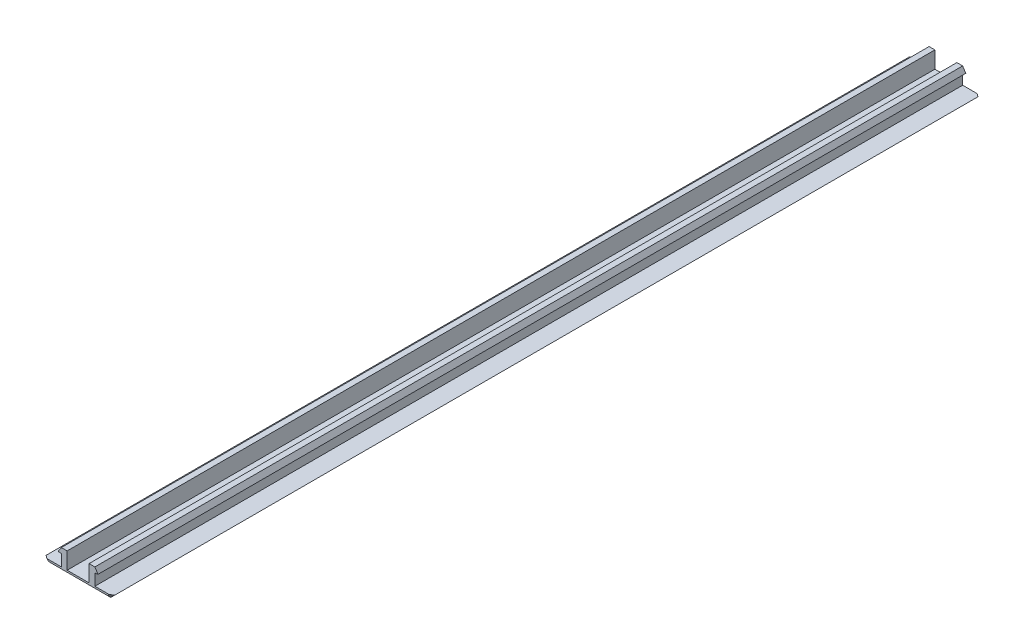
ISO-10303-21;
HEADER;
FILE_DESCRIPTION(('STEP AP214'),'2;1');
FILE_NAME('part.step','',(''),(''),'','','');
FILE_SCHEMA(('AUTOMOTIVE_DESIGN { 1 0 10303 214 1 1 1 1 }'));
ENDSEC;
DATA;
#1=APPLICATION_CONTEXT('core data for automotive mechanical design processes');
#2=APPLICATION_PROTOCOL_DEFINITION('international standard','automotive_design',2000,#1);
#3=PRODUCT_CONTEXT('',#1,'mechanical');
#4=PRODUCT('Part','Part','',(#3));
#5=PRODUCT_RELATED_PRODUCT_CATEGORY('part','',(#4));
#6=PRODUCT_DEFINITION_FORMATION('','',#4);
#7=PRODUCT_DEFINITION_CONTEXT('part definition',#1,'design');
#8=PRODUCT_DEFINITION('design','',#6,#7);
#9=PRODUCT_DEFINITION_SHAPE('','',#8);
#10=(LENGTH_UNIT() NAMED_UNIT(*) SI_UNIT(.MILLI.,.METRE.));
#11=(NAMED_UNIT(*) PLANE_ANGLE_UNIT() SI_UNIT($,.RADIAN.));
#12=(NAMED_UNIT(*) SI_UNIT($,.STERADIAN.) SOLID_ANGLE_UNIT());
#13=UNCERTAINTY_MEASURE_WITH_UNIT(LENGTH_MEASURE(1.E-05),#10,'distance_accuracy_value','');
#14=(GEOMETRIC_REPRESENTATION_CONTEXT(3) GLOBAL_UNCERTAINTY_ASSIGNED_CONTEXT((#13)) GLOBAL_UNIT_ASSIGNED_CONTEXT((#10,
#11,#12)) REPRESENTATION_CONTEXT('',''));
#15=CARTESIAN_POINT('',(0.,0.,0.));
#16=DIRECTION('',(0.,0.,1.));
#17=DIRECTION('',(1.,0.,0.));
#18=AXIS2_PLACEMENT_3D('',#15,#16,#17);
#19=CARTESIAN_POINT('',(0.,0.707109999999999,150.));
#20=DIRECTION('',(0.,-1.,0.));
#21=DIRECTION('',(0.,0.,-1.));
#22=AXIS2_PLACEMENT_3D('',#19,#20,#21);
#23=PLANE('',#22);
#24=DIRECTION('',(-1.,0.,0.));
#25=VECTOR('',#24,1.);
#26=CARTESIAN_POINT('',(0.,0.707109999999999,0.));
#27=LINE('',#26,#25);
#28=CARTESIAN_POINT('',(1.9,0.707109999999999,0.));
#29=VERTEX_POINT('',#28);
#30=CARTESIAN_POINT('',(-1.9,0.707109999999999,0.));
#31=VERTEX_POINT('',#30);
#32=EDGE_CURVE('E198',#29,#31,#27,.T.);
#33=ORIENTED_EDGE('',*,*,#32,.T.);
#34=DIRECTION('',(0.,0.,-1.));
#35=VECTOR('',#34,1.);
#36=CARTESIAN_POINT('',(-1.9,0.707109999999999,150.));
#37=LINE('',#36,#35);
#38=CARTESIAN_POINT('',(-1.9,0.707109999999999,150.));
#39=VERTEX_POINT('',#38);
#40=EDGE_CURVE('E196',#39,#31,#37,.T.);
#41=ORIENTED_EDGE('',*,*,#40,.F.);
#42=DIRECTION('',(-1.,0.,0.));
#43=VECTOR('',#42,1.);
#44=CARTESIAN_POINT('',(0.,0.707109999999999,150.));
#45=LINE('',#44,#43);
#46=CARTESIAN_POINT('',(1.9,0.707109999999999,150.));
#47=VERTEX_POINT('',#46);
#48=EDGE_CURVE('E180',#47,#39,#45,.T.);
#49=ORIENTED_EDGE('',*,*,#48,.F.);
#50=DIRECTION('',(0.,0.,-1.));
#51=VECTOR('',#50,1.);
#52=CARTESIAN_POINT('',(1.9,0.707109999999999,150.));
#53=LINE('',#52,#51);
#54=EDGE_CURVE('E232',#47,#29,#53,.T.);
#55=ORIENTED_EDGE('',*,*,#54,.T.);
#56=EDGE_LOOP('',(#33,#41,#49,#55));
#57=FACE_BOUND('',#56,.T.);
#58=ADVANCED_FACE('F41',(#57),#23,.F.);
#59=CARTESIAN_POINT('',(-1.9,0.,150.));
#60=DIRECTION('',(1.,0.,0.));
#61=DIRECTION('',(0.,1.,0.));
#62=AXIS2_PLACEMENT_3D('',#59,#60,#61);
#63=PLANE('',#62);
#64=DIRECTION('',(0.,-1.,0.));
#65=VECTOR('',#64,1.);
#66=CARTESIAN_POINT('',(-1.9,0.,0.));
#67=LINE('',#66,#65);
#68=CARTESIAN_POINT('',(-1.9,3.60069,0.));
#69=VERTEX_POINT('',#68);
#70=EDGE_CURVE('E234',#69,#31,#67,.T.);
#71=ORIENTED_EDGE('',*,*,#70,.F.);
#72=DIRECTION('',(0.,0.,-1.));
#73=VECTOR('',#72,1.);
#74=CARTESIAN_POINT('',(-1.9,3.60069,150.));
#75=LINE('',#74,#73);
#76=CARTESIAN_POINT('',(-1.9,3.60069,150.));
#77=VERTEX_POINT('',#76);
#78=EDGE_CURVE('E203',#77,#69,#75,.T.);
#79=ORIENTED_EDGE('',*,*,#78,.F.);
#80=DIRECTION('',(0.,-1.,0.));
#81=VECTOR('',#80,1.);
#82=CARTESIAN_POINT('',(-1.9,0.,150.));
#83=LINE('',#82,#81);
#84=EDGE_CURVE('E186',#77,#39,#83,.T.);
#85=ORIENTED_EDGE('',*,*,#84,.T.);
#86=ORIENTED_EDGE('',*,*,#40,.T.);
#87=EDGE_LOOP('',(#71,#79,#85,#86));
#88=FACE_BOUND('',#87,.T.);
#89=ADVANCED_FACE('F205',(#88),#63,.T.);
#90=CARTESIAN_POINT('',(0.,3.60069,150.));
#91=DIRECTION('',(0.,1.,0.));
#92=DIRECTION('',(-1.,0.,0.));
#93=AXIS2_PLACEMENT_3D('',#90,#91,#92);
#94=PLANE('',#93);
#95=DIRECTION('',(1.,0.,0.));
#96=VECTOR('',#95,1.);
#97=CARTESIAN_POINT('',(0.,3.60069,0.));
#98=LINE('',#97,#96);
#99=CARTESIAN_POINT('',(-2.9,3.60069,0.));
#100=VERTEX_POINT('',#99);
#101=EDGE_CURVE('E237',#100,#69,#98,.T.);
#102=ORIENTED_EDGE('',*,*,#101,.F.);
#103=DIRECTION('',(0.,0.,-1.));
#104=VECTOR('',#103,1.);
#105=CARTESIAN_POINT('',(-2.9,3.60069,150.));
#106=LINE('',#105,#104);
#107=CARTESIAN_POINT('',(-2.9,3.60069,150.));
#108=VERTEX_POINT('',#107);
#109=EDGE_CURVE('E297',#108,#100,#106,.T.);
#110=ORIENTED_EDGE('',*,*,#109,.F.);
#111=DIRECTION('',(1.,0.,0.));
#112=VECTOR('',#111,1.);
#113=CARTESIAN_POINT('',(0.,3.60069,150.));
#114=LINE('',#113,#112);
#115=EDGE_CURVE('E206',#108,#77,#114,.T.);
#116=ORIENTED_EDGE('',*,*,#115,.T.);
#117=ORIENTED_EDGE('',*,*,#78,.T.);
#118=EDGE_LOOP('',(#102,#110,#116,#117));
#119=FACE_BOUND('',#118,.T.);
#120=ADVANCED_FACE('F398',(#119),#94,.T.);
#121=CARTESIAN_POINT('',(-3.69232216007765,2.36224663680993,150.));
#122=DIRECTION('',(-0.842358350935223,0.538917812481358,0.));
#123=DIRECTION('',(-0.538917812481358,-0.842358350935223,0.));
#124=AXIS2_PLACEMENT_3D('',#121,#122,#123);
#125=PLANE('',#124);
#126=DIRECTION('',(0.538917812481358,0.842358350935223,0.));
#127=VECTOR('',#126,1.);
#128=CARTESIAN_POINT('',(-3.69232216007765,2.36224663680993,0.));
#129=LINE('',#128,#127);
#130=CARTESIAN_POINT('',(-3.43809865832821,2.75961203231733,0.));
#131=VERTEX_POINT('',#130);
#132=EDGE_CURVE('E240',#131,#100,#129,.T.);
#133=ORIENTED_EDGE('',*,*,#132,.F.);
#134=DIRECTION('',(0.,0.,-1.));
#135=VECTOR('',#134,1.);
#136=CARTESIAN_POINT('',(-3.43809865832821,2.75961203231733,150.));
#137=LINE('',#136,#135);
#138=CARTESIAN_POINT('',(-3.43809865832821,2.75961203231733,150.));
#139=VERTEX_POINT('',#138);
#140=EDGE_CURVE('E295',#139,#131,#137,.T.);
#141=ORIENTED_EDGE('',*,*,#140,.F.);
#142=DIRECTION('',(0.538917812481358,0.842358350935223,0.));
#143=VECTOR('',#142,1.);
#144=CARTESIAN_POINT('',(-3.69232216007765,2.36224663680993,150.));
#145=LINE('',#144,#143);
#146=EDGE_CURVE('E208',#139,#108,#145,.T.);
#147=ORIENTED_EDGE('',*,*,#146,.T.);
#148=ORIENTED_EDGE('',*,*,#109,.T.);
#149=EDGE_LOOP('',(#133,#141,#147,#148));
#150=FACE_BOUND('',#149,.T.);
#151=ADVANCED_FACE('F459',(#150),#125,.T.);
#152=CARTESIAN_POINT('',(0.298544890069291,2.26767357657699,150.));
#153=DIRECTION('',(-0.130526192220046,-0.991444861373811,0.));
#154=DIRECTION('',(0.991444861373811,-0.130526192220046,0.));
#155=AXIS2_PLACEMENT_3D('',#152,#153,#154);
#156=PLANE('',#155);
#157=DIRECTION('',(-0.991444861373811,0.130526192220046,0.));
#158=VECTOR('',#157,1.);
#159=CARTESIAN_POINT('',(0.298544890069291,2.26767357657699,0.));
#160=LINE('',#159,#158);
#161=CARTESIAN_POINT('',(-2.9,2.68877,0.));
#162=VERTEX_POINT('',#161);
#163=EDGE_CURVE('E243',#162,#131,#160,.T.);
#164=ORIENTED_EDGE('',*,*,#163,.F.);
#165=DIRECTION('',(0.,0.,-1.));
#166=VECTOR('',#165,1.);
#167=CARTESIAN_POINT('',(-2.9,2.68877,150.));
#168=LINE('',#167,#166);
#169=CARTESIAN_POINT('',(-2.9,2.68877,150.));
#170=VERTEX_POINT('',#169);
#171=EDGE_CURVE('E293',#170,#162,#168,.T.);
#172=ORIENTED_EDGE('',*,*,#171,.F.);
#173=DIRECTION('',(-0.991444861373811,0.130526192220046,0.));
#174=VECTOR('',#173,1.);
#175=CARTESIAN_POINT('',(0.298544890069291,2.26767357657699,150.));
#176=LINE('',#175,#174);
#177=EDGE_CURVE('E213',#170,#139,#176,.T.);
#178=ORIENTED_EDGE('',*,*,#177,.T.);
#179=ORIENTED_EDGE('',*,*,#140,.T.);
#180=EDGE_LOOP('',(#164,#172,#178,#179));
#181=FACE_BOUND('',#180,.T.);
#182=ADVANCED_FACE('F456',(#181),#156,.T.);
#183=CARTESIAN_POINT('',(-2.9,0.,150.));
#184=DIRECTION('',(-1.,0.,0.));
#185=DIRECTION('',(0.,0.,1.));
#186=AXIS2_PLACEMENT_3D('',#183,#184,#185);
#187=PLANE('',#186);
#188=DIRECTION('',(0.,1.,0.));
#189=VECTOR('',#188,1.);
#190=CARTESIAN_POINT('',(-2.9,0.,0.));
#191=LINE('',#190,#189);
#192=CARTESIAN_POINT('',(-2.9,0.70711,0.));
#193=VERTEX_POINT('',#192);
#194=EDGE_CURVE('E246',#193,#162,#191,.T.);
#195=ORIENTED_EDGE('',*,*,#194,.F.);
#196=DIRECTION('',(0.,0.,-1.));
#197=VECTOR('',#196,1.);
#198=CARTESIAN_POINT('',(-2.9,0.70711,150.));
#199=LINE('',#198,#197);
#200=CARTESIAN_POINT('',(-2.9,0.70711,150.));
#201=VERTEX_POINT('',#200);
#202=EDGE_CURVE('E290',#201,#193,#199,.T.);
#203=ORIENTED_EDGE('',*,*,#202,.F.);
#204=DIRECTION('',(0.,1.,0.));
#205=VECTOR('',#204,1.);
#206=CARTESIAN_POINT('',(-2.9,0.,150.));
#207=LINE('',#206,#205);
#208=EDGE_CURVE('E216',#201,#170,#207,.T.);
#209=ORIENTED_EDGE('',*,*,#208,.T.);
#210=ORIENTED_EDGE('',*,*,#171,.T.);
#211=EDGE_LOOP('',(#195,#203,#209,#210));
#212=FACE_BOUND('',#211,.T.);
#213=ADVANCED_FACE('F381',(#212),#187,.T.);
#214=CARTESIAN_POINT('',(0.,0.707109999999999,150.));
#215=DIRECTION('',(0.,1.,0.));
#216=DIRECTION('',(-1.,0.,0.));
#217=AXIS2_PLACEMENT_3D('',#214,#215,#216);
#218=PLANE('',#217);
#219=DIRECTION('',(0.,0.,-1.));
#220=VECTOR('',#219,1.);
#221=CARTESIAN_POINT('',(-5.95,0.707109999999999,150.));
#222=LINE('',#221,#220);
#223=CARTESIAN_POINT('',(-5.95,0.707109999999999,149.6));
#224=VERTEX_POINT('',#223);
#225=CARTESIAN_POINT('',(-5.95,0.707109999999999,0.400000000000011));
#226=VERTEX_POINT('',#225);
#227=EDGE_CURVE('E287',#224,#226,#222,.T.);
#228=ORIENTED_EDGE('',*,*,#227,.F.);
#229=DIRECTION('',(-0.816496580927732,0.,-0.577350269189617));
#230=VECTOR('',#229,1.);
#231=CARTESIAN_POINT('',(-1.79477152501687,0.70711,152.53819023204));
#232=LINE('',#231,#230);
#233=CARTESIAN_POINT('',(-5.38431457505077,0.70711,150.));
#234=VERTEX_POINT('',#233);
#235=EDGE_CURVE('E306',#224,#234,#232,.F.);
#236=ORIENTED_EDGE('',*,*,#235,.T.);
#237=DIRECTION('',(1.,0.,0.));
#238=VECTOR('',#237,1.);
#239=CARTESIAN_POINT('',(0.,0.707109999999999,150.));
#240=LINE('',#239,#238);
#241=EDGE_CURVE('E219',#234,#201,#240,.T.);
#242=ORIENTED_EDGE('',*,*,#241,.T.);
#243=ORIENTED_EDGE('',*,*,#202,.T.);
#244=DIRECTION('',(1.,0.,0.));
#245=VECTOR('',#244,1.);
#246=CARTESIAN_POINT('',(0.,0.707109999999999,0.));
#247=LINE('',#246,#245);
#248=CARTESIAN_POINT('',(-5.38431457505075,0.70711,0.));
#249=VERTEX_POINT('',#248);
#250=EDGE_CURVE('E249',#249,#193,#247,.T.);
#251=ORIENTED_EDGE('',*,*,#250,.F.);
#252=DIRECTION('',(-0.816496580927727,0.,0.577350269189625));
#253=VECTOR('',#252,1.);
#254=CARTESIAN_POINT('',(-72.5054496436716,0.707110000000005,47.4618097679598));
#255=LINE('',#254,#253);
#256=EDGE_CURVE('E304',#249,#226,#255,.T.);
#257=ORIENTED_EDGE('',*,*,#256,.T.);
#258=EDGE_LOOP('',(#228,#236,#242,#243,#251,#257));
#259=FACE_BOUND('',#258,.T.);
#260=ADVANCED_FACE('F374',(#259),#218,.T.);
#261=CARTESIAN_POINT('',(-2.62144499999997,-2.621445,150.));
#262=DIRECTION('',(-0.707106781186544,-0.707106781186551,0.));
#263=DIRECTION('',(0.707106781186551,-0.707106781186544,0.));
#264=AXIS2_PLACEMENT_3D('',#261,#262,#263);
#265=PLANE('',#264);
#266=DIRECTION('',(0.,0.,-1.));
#267=VECTOR('',#266,1.);
#268=CARTESIAN_POINT('',(-5.24288999999999,0.,150.));
#269=LINE('',#268,#267);
#270=CARTESIAN_POINT('',(-5.24288999999999,0.,149.6));
#271=VERTEX_POINT('',#270);
#272=CARTESIAN_POINT('',(-5.24288999999999,0.,0.400000000000011));
#273=VERTEX_POINT('',#272);
#274=EDGE_CURVE('E284',#271,#273,#269,.T.);
#275=ORIENTED_EDGE('',*,*,#274,.F.);
#276=DIRECTION('',(-0.707106781186551,0.707106781186544,0.));
#277=VECTOR('',#276,1.);
#278=CARTESIAN_POINT('',(-2.62144499999997,-2.621445,149.6));
#279=LINE('',#278,#277);
#280=EDGE_CURVE('E301',#271,#224,#279,.T.);
#281=ORIENTED_EDGE('',*,*,#280,.T.);
#282=ORIENTED_EDGE('',*,*,#227,.T.);
#283=DIRECTION('',(0.707106781186551,-0.707106781186544,0.));
#284=VECTOR('',#283,1.);
#285=CARTESIAN_POINT('',(-5.24288999999999,0.,0.400000000000011));
#286=LINE('',#285,#284);
#287=EDGE_CURVE('E202',#226,#273,#286,.T.);
#288=ORIENTED_EDGE('',*,*,#287,.T.);
#289=EDGE_LOOP('',(#275,#281,#282,#288));
#290=FACE_BOUND('',#289,.T.);
#291=ADVANCED_FACE('F364',(#290),#265,.T.);
#292=CARTESIAN_POINT('',(0.,0.,150.));
#293=DIRECTION('',(0.,1.,0.));
#294=DIRECTION('',(0.,0.,1.));
#295=AXIS2_PLACEMENT_3D('',#292,#293,#294);
#296=PLANE('',#295);
#297=DIRECTION('',(0.,0.,-1.));
#298=VECTOR('',#297,1.);
#299=CARTESIAN_POINT('',(5.24288999999999,0.,150.));
#300=LINE('',#299,#298);
#301=CARTESIAN_POINT('',(5.24288999999999,0.,149.6));
#302=VERTEX_POINT('',#301);
#303=CARTESIAN_POINT('',(5.24288999999999,0.,0.400000000000011));
#304=VERTEX_POINT('',#303);
#305=EDGE_CURVE('E281',#302,#304,#300,.T.);
#306=ORIENTED_EDGE('',*,*,#305,.F.);
#307=DIRECTION('',(-1.,0.,0.));
#308=VECTOR('',#307,1.);
#309=CARTESIAN_POINT('',(-5.24288999999999,0.,149.6));
#310=LINE('',#309,#308);
#311=EDGE_CURVE('E316',#302,#271,#310,.T.);
#312=ORIENTED_EDGE('',*,*,#311,.T.);
#313=ORIENTED_EDGE('',*,*,#274,.T.);
#314=DIRECTION('',(1.,0.,0.));
#315=VECTOR('',#314,1.);
#316=CARTESIAN_POINT('',(0.,0.,0.400000000000011));
#317=LINE('',#316,#315);
#318=EDGE_CURVE('E314',#273,#304,#317,.T.);
#319=ORIENTED_EDGE('',*,*,#318,.T.);
#320=EDGE_LOOP('',(#306,#312,#313,#319));
#321=FACE_BOUND('',#320,.T.);
#322=ADVANCED_FACE('F360',(#321),#296,.F.);
#323=CARTESIAN_POINT('',(2.62144499999997,-2.621445,150.));
#324=DIRECTION('',(0.707106781186544,-0.707106781186551,0.));
#325=DIRECTION('',(0.707106781186551,0.707106781186544,0.));
#326=AXIS2_PLACEMENT_3D('',#323,#324,#325);
#327=PLANE('',#326);
#328=DIRECTION('',(0.,0.,-1.));
#329=VECTOR('',#328,1.);
#330=CARTESIAN_POINT('',(5.95,0.70711,150.));
#331=LINE('',#330,#329);
#332=CARTESIAN_POINT('',(5.95,0.70711,149.6));
#333=VERTEX_POINT('',#332);
#334=CARTESIAN_POINT('',(5.95,0.70711,0.400000000000011));
#335=VERTEX_POINT('',#334);
#336=EDGE_CURVE('E278',#333,#335,#331,.T.);
#337=ORIENTED_EDGE('',*,*,#336,.F.);
#338=DIRECTION('',(-0.707106781186551,-0.707106781186544,0.));
#339=VECTOR('',#338,1.);
#340=CARTESIAN_POINT('',(2.62144499999997,-2.621445,149.6));
#341=LINE('',#340,#339);
#342=EDGE_CURVE('E320',#333,#302,#341,.T.);
#343=ORIENTED_EDGE('',*,*,#342,.T.);
#344=ORIENTED_EDGE('',*,*,#305,.T.);
#345=DIRECTION('',(0.707106781186551,0.707106781186544,0.));
#346=VECTOR('',#345,1.);
#347=CARTESIAN_POINT('',(5.95,0.70711,0.400000000000011));
#348=LINE('',#347,#346);
#349=EDGE_CURVE('E318',#304,#335,#348,.T.);
#350=ORIENTED_EDGE('',*,*,#349,.T.);
#351=EDGE_LOOP('',(#337,#343,#344,#350));
#352=FACE_BOUND('',#351,.T.);
#353=ADVANCED_FACE('F346',(#352),#327,.T.);
#354=CARTESIAN_POINT('',(0.,0.707109999999999,150.));
#355=DIRECTION('',(0.,-1.,0.));
#356=DIRECTION('',(1.,0.,0.));
#357=AXIS2_PLACEMENT_3D('',#354,#355,#356);
#358=PLANE('',#357);
#359=DIRECTION('',(-1.,0.,0.));
#360=VECTOR('',#359,1.);
#361=CARTESIAN_POINT('',(0.,0.707109999999999,150.));
#362=LINE('',#361,#360);
#363=CARTESIAN_POINT('',(5.38431457505077,0.70711,150.));
#364=VERTEX_POINT('',#363);
#365=CARTESIAN_POINT('',(2.9,0.70711,150.));
#366=VERTEX_POINT('',#365);
#367=EDGE_CURVE('E221',#364,#366,#362,.T.);
#368=ORIENTED_EDGE('',*,*,#367,.F.);
#369=DIRECTION('',(-0.816496580927732,0.,0.577350269189618));
#370=VECTOR('',#369,1.);
#371=CARTESIAN_POINT('',(3.73096333333328,0.707109999999999,151.169095874702));
#372=LINE('',#371,#370);
#373=EDGE_CURVE('E324',#364,#333,#372,.F.);
#374=ORIENTED_EDGE('',*,*,#373,.T.);
#375=ORIENTED_EDGE('',*,*,#336,.T.);
#376=DIRECTION('',(-0.816496580927727,0.,-0.577350269189625));
#377=VECTOR('',#376,1.);
#378=CARTESIAN_POINT('',(3.35383971670047,0.707109999999999,-1.43576254136827));
#379=LINE('',#378,#377);
#380=CARTESIAN_POINT('',(5.38431457505074,0.70711,0.));
#381=VERTEX_POINT('',#380);
#382=EDGE_CURVE('E322',#335,#381,#379,.T.);
#383=ORIENTED_EDGE('',*,*,#382,.T.);
#384=DIRECTION('',(-1.,0.,0.));
#385=VECTOR('',#384,1.);
#386=CARTESIAN_POINT('',(0.,0.707109999999999,0.));
#387=LINE('',#386,#385);
#388=CARTESIAN_POINT('',(2.9,0.70711,0.));
#389=VERTEX_POINT('',#388);
#390=EDGE_CURVE('E251',#381,#389,#387,.T.);
#391=ORIENTED_EDGE('',*,*,#390,.T.);
#392=DIRECTION('',(0.,0.,-1.));
#393=VECTOR('',#392,1.);
#394=CARTESIAN_POINT('',(2.9,0.70711,150.));
#395=LINE('',#394,#393);
#396=EDGE_CURVE('E275',#366,#389,#395,.T.);
#397=ORIENTED_EDGE('',*,*,#396,.F.);
#398=EDGE_LOOP('',(#368,#374,#375,#383,#391,#397));
#399=FACE_BOUND('',#398,.T.);
#400=ADVANCED_FACE('F351',(#399),#358,.F.);
#401=CARTESIAN_POINT('',(2.9,0.,150.));
#402=DIRECTION('',(-1.,0.,0.));
#403=DIRECTION('',(0.,0.,1.));
#404=AXIS2_PLACEMENT_3D('',#401,#402,#403);
#405=PLANE('',#404);
#406=DIRECTION('',(0.,1.,0.));
#407=VECTOR('',#406,1.);
#408=CARTESIAN_POINT('',(2.9,0.,0.));
#409=LINE('',#408,#407);
#410=CARTESIAN_POINT('',(2.9,2.68877,0.));
#411=VERTEX_POINT('',#410);
#412=EDGE_CURVE('E253',#389,#411,#409,.T.);
#413=ORIENTED_EDGE('',*,*,#412,.T.);
#414=DIRECTION('',(0.,0.,-1.));
#415=VECTOR('',#414,1.);
#416=CARTESIAN_POINT('',(2.9,2.68877,150.));
#417=LINE('',#416,#415);
#418=CARTESIAN_POINT('',(2.9,2.68877,150.));
#419=VERTEX_POINT('',#418);
#420=EDGE_CURVE('E272',#419,#411,#417,.T.);
#421=ORIENTED_EDGE('',*,*,#420,.F.);
#422=DIRECTION('',(0.,1.,0.));
#423=VECTOR('',#422,1.);
#424=CARTESIAN_POINT('',(2.9,0.,150.));
#425=LINE('',#424,#423);
#426=EDGE_CURVE('E223',#366,#419,#425,.T.);
#427=ORIENTED_EDGE('',*,*,#426,.F.);
#428=ORIENTED_EDGE('',*,*,#396,.T.);
#429=EDGE_LOOP('',(#413,#421,#427,#428));
#430=FACE_BOUND('',#429,.T.);
#431=ADVANCED_FACE('F439',(#430),#405,.F.);
#432=CARTESIAN_POINT('',(-0.298544890069291,2.26767357657699,150.));
#433=DIRECTION('',(-0.130526192220046,0.991444861373811,0.));
#434=DIRECTION('',(-0.991444861373811,-0.130526192220046,0.));
#435=AXIS2_PLACEMENT_3D('',#432,#433,#434);
#436=PLANE('',#435);
#437=DIRECTION('',(0.991444861373811,0.130526192220046,0.));
#438=VECTOR('',#437,1.);
#439=CARTESIAN_POINT('',(-0.298544890069291,2.26767357657699,0.));
#440=LINE('',#439,#438);
#441=CARTESIAN_POINT('',(3.43809865832821,2.75961203231733,0.));
#442=VERTEX_POINT('',#441);
#443=EDGE_CURVE('E255',#411,#442,#440,.T.);
#444=ORIENTED_EDGE('',*,*,#443,.T.);
#445=DIRECTION('',(0.,0.,-1.));
#446=VECTOR('',#445,1.);
#447=CARTESIAN_POINT('',(3.43809865832821,2.75961203231733,150.));
#448=LINE('',#447,#446);
#449=CARTESIAN_POINT('',(3.43809865832821,2.75961203231733,150.));
#450=VERTEX_POINT('',#449);
#451=EDGE_CURVE('E269',#450,#442,#448,.T.);
#452=ORIENTED_EDGE('',*,*,#451,.F.);
#453=DIRECTION('',(0.991444861373811,0.130526192220046,0.));
#454=VECTOR('',#453,1.);
#455=CARTESIAN_POINT('',(-0.298544890069291,2.26767357657699,150.));
#456=LINE('',#455,#454);
#457=EDGE_CURVE('E225',#419,#450,#456,.T.);
#458=ORIENTED_EDGE('',*,*,#457,.F.);
#459=ORIENTED_EDGE('',*,*,#420,.T.);
#460=EDGE_LOOP('',(#444,#452,#458,#459));
#461=FACE_BOUND('',#460,.T.);
#462=ADVANCED_FACE('F435',(#461),#436,.F.);
#463=CARTESIAN_POINT('',(3.69232216007765,2.36224663680993,150.));
#464=DIRECTION('',(-0.842358350935223,-0.538917812481358,0.));
#465=DIRECTION('',(0.538917812481358,-0.842358350935223,0.));
#466=AXIS2_PLACEMENT_3D('',#463,#464,#465);
#467=PLANE('',#466);
#468=DIRECTION('',(-0.538917812481358,0.842358350935223,0.));
#469=VECTOR('',#468,1.);
#470=CARTESIAN_POINT('',(3.69232216007765,2.36224663680993,0.));
#471=LINE('',#470,#469);
#472=CARTESIAN_POINT('',(2.9,3.60069,0.));
#473=VERTEX_POINT('',#472);
#474=EDGE_CURVE('E257',#442,#473,#471,.T.);
#475=ORIENTED_EDGE('',*,*,#474,.T.);
#476=DIRECTION('',(0.,0.,-1.));
#477=VECTOR('',#476,1.);
#478=CARTESIAN_POINT('',(2.9,3.60069,150.));
#479=LINE('',#478,#477);
#480=CARTESIAN_POINT('',(2.9,3.60069,150.));
#481=VERTEX_POINT('',#480);
#482=EDGE_CURVE('E266',#481,#473,#479,.T.);
#483=ORIENTED_EDGE('',*,*,#482,.F.);
#484=DIRECTION('',(-0.538917812481358,0.842358350935223,0.));
#485=VECTOR('',#484,1.);
#486=CARTESIAN_POINT('',(3.69232216007765,2.36224663680993,150.));
#487=LINE('',#486,#485);
#488=EDGE_CURVE('E227',#450,#481,#487,.T.);
#489=ORIENTED_EDGE('',*,*,#488,.F.);
#490=ORIENTED_EDGE('',*,*,#451,.T.);
#491=EDGE_LOOP('',(#475,#483,#489,#490));
#492=FACE_BOUND('',#491,.T.);
#493=ADVANCED_FACE('F431',(#492),#467,.F.);
#494=CARTESIAN_POINT('',(0.,3.60069,150.));
#495=DIRECTION('',(0.,-1.,0.));
#496=DIRECTION('',(1.,0.,0.));
#497=AXIS2_PLACEMENT_3D('',#494,#495,#496);
#498=PLANE('',#497);
#499=DIRECTION('',(-1.,0.,0.));
#500=VECTOR('',#499,1.);
#501=CARTESIAN_POINT('',(0.,3.60069,0.));
#502=LINE('',#501,#500);
#503=CARTESIAN_POINT('',(1.9,3.60069,0.));
#504=VERTEX_POINT('',#503);
#505=EDGE_CURVE('E259',#473,#504,#502,.T.);
#506=ORIENTED_EDGE('',*,*,#505,.T.);
#507=DIRECTION('',(0.,0.,-1.));
#508=VECTOR('',#507,1.);
#509=CARTESIAN_POINT('',(1.9,3.60069,150.));
#510=LINE('',#509,#508);
#511=CARTESIAN_POINT('',(1.9,3.60069,150.));
#512=VERTEX_POINT('',#511);
#513=EDGE_CURVE('E263',#512,#504,#510,.T.);
#514=ORIENTED_EDGE('',*,*,#513,.F.);
#515=DIRECTION('',(-1.,0.,0.));
#516=VECTOR('',#515,1.);
#517=CARTESIAN_POINT('',(0.,3.60069,150.));
#518=LINE('',#517,#516);
#519=EDGE_CURVE('E229',#481,#512,#518,.T.);
#520=ORIENTED_EDGE('',*,*,#519,.F.);
#521=ORIENTED_EDGE('',*,*,#482,.T.);
#522=EDGE_LOOP('',(#506,#514,#520,#521));
#523=FACE_BOUND('',#522,.T.);
#524=ADVANCED_FACE('F427',(#523),#498,.F.);
#525=CARTESIAN_POINT('',(1.9,0.,150.));
#526=DIRECTION('',(1.,0.,0.));
#527=DIRECTION('',(0.,1.,0.));
#528=AXIS2_PLACEMENT_3D('',#525,#526,#527);
#529=PLANE('',#528);
#530=DIRECTION('',(0.,-1.,0.));
#531=VECTOR('',#530,1.);
#532=CARTESIAN_POINT('',(1.9,0.,0.));
#533=LINE('',#532,#531);
#534=EDGE_CURVE('E193',#504,#29,#533,.T.);
#535=ORIENTED_EDGE('',*,*,#534,.T.);
#536=ORIENTED_EDGE('',*,*,#54,.F.);
#537=DIRECTION('',(0.,-1.,0.));
#538=VECTOR('',#537,1.);
#539=CARTESIAN_POINT('',(1.9,0.,150.));
#540=LINE('',#539,#538);
#541=EDGE_CURVE('E189',#512,#47,#540,.T.);
#542=ORIENTED_EDGE('',*,*,#541,.F.);
#543=ORIENTED_EDGE('',*,*,#513,.T.);
#544=EDGE_LOOP('',(#535,#536,#542,#543));
#545=FACE_BOUND('',#544,.T.);
#546=ADVANCED_FACE('F422',(#545),#529,.F.);
#547=CARTESIAN_POINT('',(0.,0.,150.));
#548=DIRECTION('',(0.,0.,1.));
#549=DIRECTION('',(1.,0.,0.));
#550=AXIS2_PLACEMENT_3D('',#547,#548,#549);
#551=PLANE('',#550);
#552=ORIENTED_EDGE('',*,*,#241,.F.);
#553=DIRECTION('',(0.707106781186551,-0.707106781186544,0.));
#554=VECTOR('',#553,1.);
#555=CARTESIAN_POINT('',(-2.33860228752536,-2.33860228752538,150.));
#556=LINE('',#555,#554);
#557=CARTESIAN_POINT('',(-5.07720457505076,0.399999999999991,150.));
#558=VERTEX_POINT('',#557);
#559=EDGE_CURVE('E312',#234,#558,#556,.T.);
#560=ORIENTED_EDGE('',*,*,#559,.T.);
#561=DIRECTION('',(1.,0.,0.));
#562=VECTOR('',#561,1.);
#563=CARTESIAN_POINT('',(5.24288999999999,0.399999999999991,150.));
#564=LINE('',#563,#562);
#565=CARTESIAN_POINT('',(5.07720457505076,0.399999999999991,150.));
#566=VERTEX_POINT('',#565);
#567=EDGE_CURVE('E310',#558,#566,#564,.T.);
#568=ORIENTED_EDGE('',*,*,#567,.T.);
#569=DIRECTION('',(0.707106781186551,0.707106781186544,0.));
#570=VECTOR('',#569,1.);
#571=CARTESIAN_POINT('',(2.33860228752536,-2.33860228752538,150.));
#572=LINE('',#571,#570);
#573=EDGE_CURVE('E308',#566,#364,#572,.T.);
#574=ORIENTED_EDGE('',*,*,#573,.T.);
#575=ORIENTED_EDGE('',*,*,#367,.T.);
#576=ORIENTED_EDGE('',*,*,#426,.T.);
#577=ORIENTED_EDGE('',*,*,#457,.T.);
#578=ORIENTED_EDGE('',*,*,#488,.T.);
#579=ORIENTED_EDGE('',*,*,#519,.T.);
#580=ORIENTED_EDGE('',*,*,#541,.T.);
#581=ORIENTED_EDGE('',*,*,#48,.T.);
#582=ORIENTED_EDGE('',*,*,#84,.F.);
#583=ORIENTED_EDGE('',*,*,#115,.F.);
#584=ORIENTED_EDGE('',*,*,#146,.F.);
#585=ORIENTED_EDGE('',*,*,#177,.F.);
#586=ORIENTED_EDGE('',*,*,#208,.F.);
#587=EDGE_LOOP('',(#552,#560,#568,#574,#575,#576,#577,#578,#579,#580,#581,#582,#583,#584,#585,#586));
#588=FACE_BOUND('',#587,.T.);
#589=ADVANCED_FACE('F183',(#588),#551,.T.);
#590=CARTESIAN_POINT('',(0.,0.,0.));
#591=DIRECTION('',(0.,0.,1.));
#592=DIRECTION('',(1.,0.,0.));
#593=AXIS2_PLACEMENT_3D('',#590,#591,#592);
#594=PLANE('',#593);
#595=DIRECTION('',(-1.,0.,0.));
#596=VECTOR('',#595,1.);
#597=CARTESIAN_POINT('',(0.,0.40000000000001,0.));
#598=LINE('',#597,#596);
#599=CARTESIAN_POINT('',(5.07720457505075,0.40000000000001,0.));
#600=VERTEX_POINT('',#599);
#601=CARTESIAN_POINT('',(-5.07720457505075,0.40000000000001,0.));
#602=VERTEX_POINT('',#601);
#603=EDGE_CURVE('E51',#600,#602,#598,.T.);
#604=ORIENTED_EDGE('',*,*,#603,.T.);
#605=DIRECTION('',(-0.707106781186551,0.707106781186544,0.));
#606=VECTOR('',#605,1.);
#607=CARTESIAN_POINT('',(-5.66715728752538,0.989952712474627,0.));
#608=LINE('',#607,#606);
#609=EDGE_CURVE('E11',#602,#249,#608,.T.);
#610=ORIENTED_EDGE('',*,*,#609,.T.);
#611=ORIENTED_EDGE('',*,*,#250,.T.);
#612=ORIENTED_EDGE('',*,*,#194,.T.);
#613=ORIENTED_EDGE('',*,*,#163,.T.);
#614=ORIENTED_EDGE('',*,*,#132,.T.);
#615=ORIENTED_EDGE('',*,*,#101,.T.);
#616=ORIENTED_EDGE('',*,*,#70,.T.);
#617=ORIENTED_EDGE('',*,*,#32,.F.);
#618=ORIENTED_EDGE('',*,*,#534,.F.);
#619=ORIENTED_EDGE('',*,*,#505,.F.);
#620=ORIENTED_EDGE('',*,*,#474,.F.);
#621=ORIENTED_EDGE('',*,*,#443,.F.);
#622=ORIENTED_EDGE('',*,*,#412,.F.);
#623=ORIENTED_EDGE('',*,*,#390,.F.);
#624=DIRECTION('',(-0.707106781186551,-0.707106781186544,0.));
#625=VECTOR('',#624,1.);
#626=CARTESIAN_POINT('',(4.96004728752537,0.282842712474628,0.));
#627=LINE('',#626,#625);
#628=EDGE_CURVE('E62',#381,#600,#627,.T.);
#629=ORIENTED_EDGE('',*,*,#628,.T.);
#630=EDGE_LOOP('',(#604,#610,#611,#612,#613,#614,#615,#616,#617,#618,#619,#620,#621,#622,#623,#629));
#631=FACE_BOUND('',#630,.T.);
#632=ADVANCED_FACE('F384',(#631),#594,.F.);
#633=CARTESIAN_POINT('',(2.62144499999997,-2.621445,149.6));
#634=DIRECTION('',(-0.499999999999993,0.499999999999999,-0.707106781186553));
#635=DIRECTION('',(-0.707106781186551,-0.707106781186544,0.));
#636=AXIS2_PLACEMENT_3D('',#633,#634,#635);
#637=PLANE('',#636);
#638=ORIENTED_EDGE('',*,*,#373,.F.);
#639=ORIENTED_EDGE('',*,*,#573,.F.);
#640=DIRECTION('',(-0.281084637714819,0.678598344545853,0.678598344545841));
#641=VECTOR('',#640,1.);
#642=CARTESIAN_POINT('',(5.53579714730034,-0.707140407528534,148.892859592471));
#643=LINE('',#642,#641);
#644=EDGE_CURVE('E235',#302,#566,#643,.T.);
#645=ORIENTED_EDGE('',*,*,#644,.F.);
#646=ORIENTED_EDGE('',*,*,#342,.F.);
#647=EDGE_LOOP('',(#638,#639,#645,#646));
#648=FACE_BOUND('',#647,.T.);
#649=ADVANCED_FACE('F356',(#648),#637,.F.);
#650=CARTESIAN_POINT('',(0.,0.399999999999991,150.));
#651=DIRECTION('',(0.,-0.707106781186541,0.707106781186554));
#652=DIRECTION('',(-1.,0.,0.));
#653=AXIS2_PLACEMENT_3D('',#650,#651,#652);
#654=PLANE('',#653);
#655=ORIENTED_EDGE('',*,*,#644,.T.);
#656=ORIENTED_EDGE('',*,*,#567,.F.);
#657=DIRECTION('',(0.281084637714821,0.678598344545853,0.678598344545841));
#658=VECTOR('',#657,1.);
#659=CARTESIAN_POINT('',(-4.67606188390739,1.36844412540516,150.968444125405));
#660=LINE('',#659,#658);
#661=EDGE_CURVE('E328',#271,#558,#660,.T.);
#662=ORIENTED_EDGE('',*,*,#661,.F.);
#663=ORIENTED_EDGE('',*,*,#311,.F.);
#664=EDGE_LOOP('',(#655,#656,#662,#663));
#665=FACE_BOUND('',#664,.T.);
#666=ADVANCED_FACE('F369',(#665),#654,.T.);
#667=CARTESIAN_POINT('',(-2.62144499999997,-2.621445,149.6));
#668=DIRECTION('',(0.499999999999993,0.499999999999998,-0.707106781186554));
#669=DIRECTION('',(-0.707106781186551,0.707106781186544,0.));
#670=AXIS2_PLACEMENT_3D('',#667,#668,#669);
#671=PLANE('',#670);
#672=ORIENTED_EDGE('',*,*,#661,.T.);
#673=ORIENTED_EDGE('',*,*,#559,.F.);
#674=ORIENTED_EDGE('',*,*,#235,.F.);
#675=ORIENTED_EDGE('',*,*,#280,.F.);
#676=EDGE_LOOP('',(#672,#673,#674,#675));
#677=FACE_BOUND('',#676,.T.);
#678=ADVANCED_FACE('F372',(#677),#671,.F.);
#679=CARTESIAN_POINT('',(2.33860228752534,-2.33860228752537,0.));
#680=DIRECTION('',(0.499999999999998,-0.500000000000004,-0.707106781186546));
#681=DIRECTION('',(0.707106781186551,0.707106781186544,0.));
#682=AXIS2_PLACEMENT_3D('',#679,#680,#681);
#683=PLANE('',#682);
#684=ORIENTED_EDGE('',*,*,#382,.F.);
#685=ORIENTED_EDGE('',*,*,#349,.F.);
#686=DIRECTION('',(0.281084637714817,-0.678598344545847,0.678598344545849));
#687=VECTOR('',#686,1.);
#688=CARTESIAN_POINT('',(5.3832022914359,-0.338743836952217,0.73874383695223));
#689=LINE('',#688,#687);
#690=EDGE_CURVE('E46',#600,#304,#689,.T.);
#691=ORIENTED_EDGE('',*,*,#690,.F.);
#692=ORIENTED_EDGE('',*,*,#628,.F.);
#693=EDGE_LOOP('',(#684,#685,#691,#692));
#694=FACE_BOUND('',#693,.T.);
#695=ADVANCED_FACE('F44',(#694),#683,.T.);
#696=CARTESIAN_POINT('',(0.,0.,0.400000000000011));
#697=DIRECTION('',(0.,0.707106781186549,0.707106781186547));
#698=DIRECTION('',(1.,0.,0.));
#699=AXIS2_PLACEMENT_3D('',#696,#697,#698);
#700=PLANE('',#699);
#701=ORIENTED_EDGE('',*,*,#690,.T.);
#702=ORIENTED_EDGE('',*,*,#318,.F.);
#703=DIRECTION('',(-0.281084637714818,-0.678598344545846,0.678598344545848));
#704=VECTOR('',#703,1.);
#705=CARTESIAN_POINT('',(-4.82865673977183,1.00004755482886,-0.600047554828854));
#706=LINE('',#705,#704);
#707=EDGE_CURVE('E332',#602,#273,#706,.T.);
#708=ORIENTED_EDGE('',*,*,#707,.F.);
#709=ORIENTED_EDGE('',*,*,#603,.F.);
#710=EDGE_LOOP('',(#701,#702,#708,#709));
#711=FACE_BOUND('',#710,.T.);
#712=ADVANCED_FACE('F340',(#711),#700,.F.);
#713=CARTESIAN_POINT('',(-2.33860228752534,-2.33860228752537,0.));
#714=DIRECTION('',(-0.499999999999998,-0.500000000000003,-0.707106781186547));
#715=DIRECTION('',(0.707106781186551,-0.707106781186544,0.));
#716=AXIS2_PLACEMENT_3D('',#713,#714,#715);
#717=PLANE('',#716);
#718=ORIENTED_EDGE('',*,*,#707,.T.);
#719=ORIENTED_EDGE('',*,*,#287,.F.);
#720=ORIENTED_EDGE('',*,*,#256,.F.);
#721=ORIENTED_EDGE('',*,*,#609,.F.);
#722=EDGE_LOOP('',(#718,#719,#720,#721));
#723=FACE_BOUND('',#722,.T.);
#724=ADVANCED_FACE('F385',(#723),#717,.T.);
#725=CLOSED_SHELL('',(#58,#89,#120,#151,#182,#213,#260,#291,#322,#353,#400,#431,#462,#493,#524,
#546,#589,#632,#649,#666,#678,#695,#712,#724));
#726=MANIFOLD_SOLID_BREP('B2',#725);
#727=ADVANCED_BREP_SHAPE_REPRESENTATION('',(#18,#726),#14);
#728=SHAPE_DEFINITION_REPRESENTATION(#9,#727);
ENDSEC;
END-ISO-10303-21;
